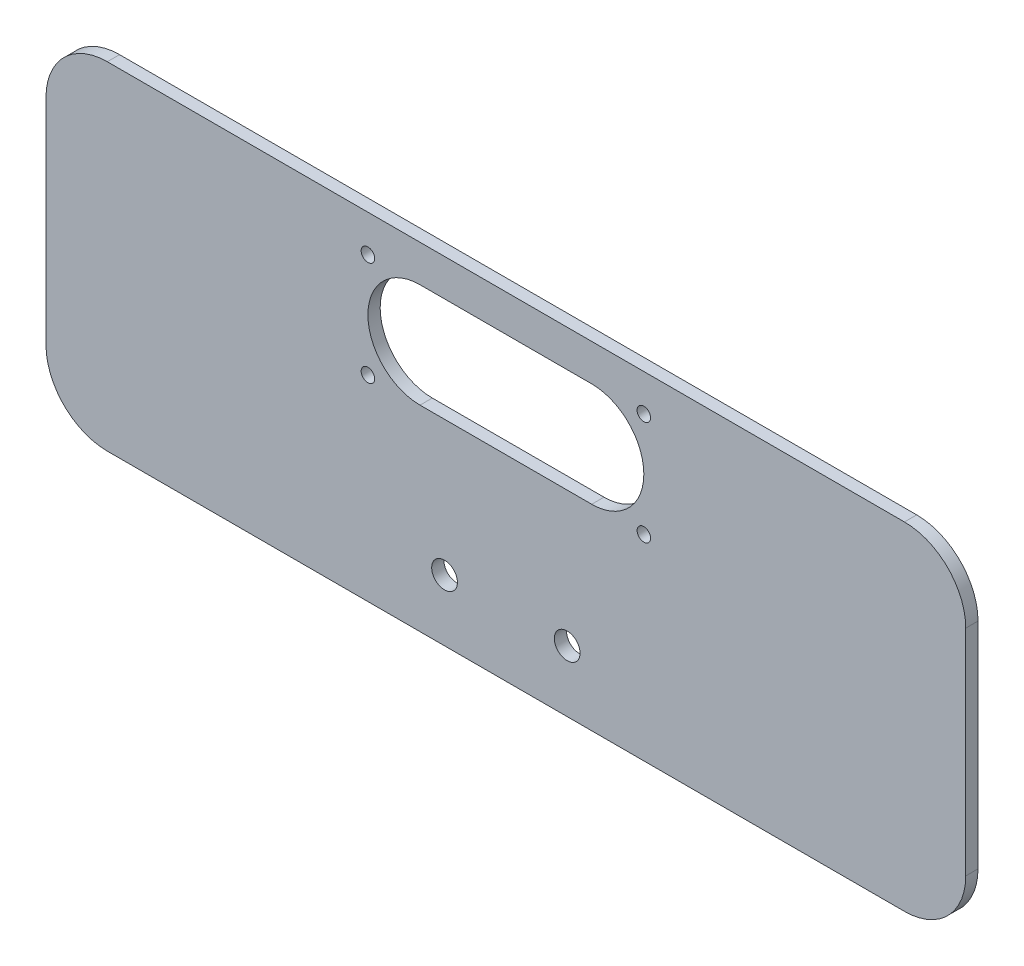
ISO-10303-21;
HEADER;
FILE_DESCRIPTION(('STEP AP214'),'2;1');
FILE_NAME('part.step','',(''),(''),'','','');
FILE_SCHEMA(('AUTOMOTIVE_DESIGN { 1 0 10303 214 1 1 1 1 }'));
ENDSEC;
DATA;
#1=APPLICATION_CONTEXT('core data for automotive mechanical design processes');
#2=APPLICATION_PROTOCOL_DEFINITION('international standard','automotive_design',2000,#1);
#3=PRODUCT_CONTEXT('',#1,'mechanical');
#4=PRODUCT('Part','Part','',(#3));
#5=PRODUCT_RELATED_PRODUCT_CATEGORY('part','',(#4));
#6=PRODUCT_DEFINITION_FORMATION('','',#4);
#7=PRODUCT_DEFINITION_CONTEXT('part definition',#1,'design');
#8=PRODUCT_DEFINITION('design','',#6,#7);
#9=PRODUCT_DEFINITION_SHAPE('','',#8);
#10=(LENGTH_UNIT() NAMED_UNIT(*) SI_UNIT(.MILLI.,.METRE.));
#11=(NAMED_UNIT(*) PLANE_ANGLE_UNIT() SI_UNIT($,.RADIAN.));
#12=(NAMED_UNIT(*) SI_UNIT($,.STERADIAN.) SOLID_ANGLE_UNIT());
#13=UNCERTAINTY_MEASURE_WITH_UNIT(LENGTH_MEASURE(1.E-05),#10,'distance_accuracy_value','');
#14=(GEOMETRIC_REPRESENTATION_CONTEXT(3) GLOBAL_UNCERTAINTY_ASSIGNED_CONTEXT((#13)) GLOBAL_UNIT_ASSIGNED_CONTEXT((#10,
#11,#12)) REPRESENTATION_CONTEXT('',''));
#15=CARTESIAN_POINT('',(0.,0.,0.));
#16=DIRECTION('',(0.,0.,1.));
#17=DIRECTION('',(1.,0.,0.));
#18=AXIS2_PLACEMENT_3D('',#15,#16,#17);
#19=CARTESIAN_POINT('',(65.,-17.5,2.));
#20=DIRECTION('',(0.,0.,1.));
#21=DIRECTION('',(1.,0.,0.));
#22=AXIS2_PLACEMENT_3D('',#19,#20,#21);
#23=PLANE('',#22);
#24=CARTESIAN_POINT('',(22.5,4.50000000000001,2.));
#25=DIRECTION('',(0.,0.,1.));
#26=DIRECTION('',(1.,0.,0.));
#27=AXIS2_PLACEMENT_3D('',#24,#25,#26);
#28=CIRCLE('',#27,1.1);
#29=CARTESIAN_POINT('',(23.6,4.50000000000001,2.));
#30=VERTEX_POINT('',#29);
#31=EDGE_CURVE('E344',#30,#30,#28,.T.);
#32=ORIENTED_EDGE('',*,*,#31,.F.);
#33=EDGE_LOOP('',(#32));
#34=FACE_BOUND('',#33,.T.);
#35=CARTESIAN_POINT('',(-22.5,21.5,2.));
#36=DIRECTION('',(0.,0.,1.));
#37=DIRECTION('',(1.,0.,0.));
#38=AXIS2_PLACEMENT_3D('',#35,#36,#37);
#39=CIRCLE('',#38,1.1);
#40=CARTESIAN_POINT('',(-21.4,21.5,2.));
#41=VERTEX_POINT('',#40);
#42=EDGE_CURVE('E356',#41,#41,#39,.T.);
#43=ORIENTED_EDGE('',*,*,#42,.F.);
#44=EDGE_LOOP('',(#43));
#45=FACE_BOUND('',#44,.T.);
#46=DIRECTION('',(1.,0.,0.));
#47=VECTOR('',#46,1.);
#48=CARTESIAN_POINT('',(-14.,4.50000000000001,2.));
#49=LINE('',#48,#47);
#50=CARTESIAN_POINT('',(-14.,4.50000000000001,2.));
#51=VERTEX_POINT('',#50);
#52=CARTESIAN_POINT('',(14.,4.49999999999998,2.));
#53=VERTEX_POINT('',#52);
#54=EDGE_CURVE('E136',#51,#53,#49,.T.);
#55=ORIENTED_EDGE('',*,*,#54,.F.);
#56=CARTESIAN_POINT('',(-14.,13.,2.));
#57=DIRECTION('',(0.,0.,1.));
#58=DIRECTION('',(1.,0.,0.));
#59=AXIS2_PLACEMENT_3D('',#56,#57,#58);
#60=CIRCLE('',#59,8.5);
#61=CARTESIAN_POINT('',(-14.,21.5,2.));
#62=VERTEX_POINT('',#61);
#63=EDGE_CURVE('E128',#62,#51,#60,.T.);
#64=ORIENTED_EDGE('',*,*,#63,.F.);
#65=DIRECTION('',(-1.,0.,0.));
#66=VECTOR('',#65,1.);
#67=CARTESIAN_POINT('',(-14.,21.5,2.));
#68=LINE('',#67,#66);
#69=CARTESIAN_POINT('',(14.,21.5,2.));
#70=VERTEX_POINT('',#69);
#71=EDGE_CURVE('E151',#70,#62,#68,.T.);
#72=ORIENTED_EDGE('',*,*,#71,.F.);
#73=CARTESIAN_POINT('',(14.,13.,2.));
#74=DIRECTION('',(0.,0.,1.));
#75=DIRECTION('',(1.,0.,0.));
#76=AXIS2_PLACEMENT_3D('',#73,#74,#75);
#77=CIRCLE('',#76,8.5);
#78=EDGE_CURVE('E149',#53,#70,#77,.T.);
#79=ORIENTED_EDGE('',*,*,#78,.F.);
#80=EDGE_LOOP('',(#55,#64,#72,#79));
#81=FACE_BOUND('',#80,.T.);
#82=CARTESIAN_POINT('',(-10.,-17.5,2.));
#83=DIRECTION('',(0.,0.,1.));
#84=DIRECTION('',(1.,0.,0.));
#85=AXIS2_PLACEMENT_3D('',#82,#83,#84);
#86=CIRCLE('',#85,2.1);
#87=CARTESIAN_POINT('',(-7.9,-17.5,2.));
#88=VERTEX_POINT('',#87);
#89=EDGE_CURVE('E167',#88,#88,#86,.T.);
#90=ORIENTED_EDGE('',*,*,#89,.F.);
#91=EDGE_LOOP('',(#90));
#92=FACE_BOUND('',#91,.T.);
#93=CARTESIAN_POINT('',(65.,-17.5,2.));
#94=DIRECTION('',(0.,0.,1.));
#95=DIRECTION('',(1.,0.,0.));
#96=AXIS2_PLACEMENT_3D('',#93,#94,#95);
#97=CIRCLE('',#96,10.);
#98=CARTESIAN_POINT('',(65.,-27.5,2.));
#99=VERTEX_POINT('',#98);
#100=CARTESIAN_POINT('',(75.,-17.5,2.));
#101=VERTEX_POINT('',#100);
#102=EDGE_CURVE('E173',#99,#101,#97,.T.);
#103=ORIENTED_EDGE('',*,*,#102,.T.);
#104=DIRECTION('',(0.,1.,0.));
#105=VECTOR('',#104,1.);
#106=CARTESIAN_POINT('',(75.,17.5,2.));
#107=LINE('',#106,#105);
#108=CARTESIAN_POINT('',(75.,17.5,2.));
#109=VERTEX_POINT('',#108);
#110=EDGE_CURVE('E176',#101,#109,#107,.T.);
#111=ORIENTED_EDGE('',*,*,#110,.T.);
#112=CARTESIAN_POINT('',(65.,17.5,2.));
#113=DIRECTION('',(0.,0.,1.));
#114=DIRECTION('',(-1.,0.,0.));
#115=AXIS2_PLACEMENT_3D('',#112,#113,#114);
#116=CIRCLE('',#115,10.);
#117=CARTESIAN_POINT('',(65.,27.5,2.));
#118=VERTEX_POINT('',#117);
#119=EDGE_CURVE('E179',#109,#118,#116,.T.);
#120=ORIENTED_EDGE('',*,*,#119,.T.);
#121=DIRECTION('',(-1.,0.,0.));
#122=VECTOR('',#121,1.);
#123=CARTESIAN_POINT('',(-65.,27.5,2.));
#124=LINE('',#123,#122);
#125=CARTESIAN_POINT('',(-65.,27.5,2.));
#126=VERTEX_POINT('',#125);
#127=EDGE_CURVE('E181',#118,#126,#124,.T.);
#128=ORIENTED_EDGE('',*,*,#127,.T.);
#129=CARTESIAN_POINT('',(-65.,17.5,2.));
#130=DIRECTION('',(0.,0.,1.));
#131=DIRECTION('',(1.,0.,0.));
#132=AXIS2_PLACEMENT_3D('',#129,#130,#131);
#133=CIRCLE('',#132,10.);
#134=CARTESIAN_POINT('',(-75.,17.5,2.));
#135=VERTEX_POINT('',#134);
#136=EDGE_CURVE('E183',#126,#135,#133,.T.);
#137=ORIENTED_EDGE('',*,*,#136,.T.);
#138=DIRECTION('',(0.,-1.,0.));
#139=VECTOR('',#138,1.);
#140=CARTESIAN_POINT('',(-75.,17.5,2.));
#141=LINE('',#140,#139);
#142=CARTESIAN_POINT('',(-75.,-17.5,2.));
#143=VERTEX_POINT('',#142);
#144=EDGE_CURVE('E185',#135,#143,#141,.T.);
#145=ORIENTED_EDGE('',*,*,#144,.T.);
#146=CARTESIAN_POINT('',(-65.,-17.5,2.));
#147=DIRECTION('',(0.,0.,1.));
#148=DIRECTION('',(1.,0.,0.));
#149=AXIS2_PLACEMENT_3D('',#146,#147,#148);
#150=CIRCLE('',#149,10.);
#151=CARTESIAN_POINT('',(-65.,-27.5,2.));
#152=VERTEX_POINT('',#151);
#153=EDGE_CURVE('E187',#143,#152,#150,.T.);
#154=ORIENTED_EDGE('',*,*,#153,.T.);
#155=DIRECTION('',(1.,0.,0.));
#156=VECTOR('',#155,1.);
#157=CARTESIAN_POINT('',(-65.,-27.5,2.));
#158=LINE('',#157,#156);
#159=EDGE_CURVE('E189',#152,#99,#158,.T.);
#160=ORIENTED_EDGE('',*,*,#159,.T.);
#161=EDGE_LOOP('',(#103,#111,#120,#128,#137,#145,#154,#160));
#162=FACE_BOUND('',#161,.T.);
#163=CARTESIAN_POINT('',(10.,-17.5,2.));
#164=DIRECTION('',(0.,0.,1.));
#165=DIRECTION('',(-1.,0.,0.));
#166=AXIS2_PLACEMENT_3D('',#163,#164,#165);
#167=CIRCLE('',#166,2.1);
#168=CARTESIAN_POINT('',(7.9,-17.5,2.));
#169=VERTEX_POINT('',#168);
#170=EDGE_CURVE('E157',#169,#169,#167,.T.);
#171=ORIENTED_EDGE('',*,*,#170,.F.);
#172=EDGE_LOOP('',(#171));
#173=FACE_BOUND('',#172,.T.);
#174=CARTESIAN_POINT('',(-22.5,4.50000000000001,2.));
#175=DIRECTION('',(0.,0.,1.));
#176=DIRECTION('',(-1.,0.,0.));
#177=AXIS2_PLACEMENT_3D('',#174,#175,#176);
#178=CIRCLE('',#177,1.1);
#179=CARTESIAN_POINT('',(-23.6,4.50000000000001,2.));
#180=VERTEX_POINT('',#179);
#181=EDGE_CURVE('E350',#180,#180,#178,.T.);
#182=ORIENTED_EDGE('',*,*,#181,.F.);
#183=EDGE_LOOP('',(#182));
#184=FACE_BOUND('',#183,.T.);
#185=CARTESIAN_POINT('',(22.5,21.5,2.));
#186=DIRECTION('',(0.,0.,1.));
#187=DIRECTION('',(-1.,0.,0.));
#188=AXIS2_PLACEMENT_3D('',#185,#186,#187);
#189=CIRCLE('',#188,1.1);
#190=CARTESIAN_POINT('',(21.4,21.5,2.));
#191=VERTEX_POINT('',#190);
#192=EDGE_CURVE('E335',#191,#191,#189,.T.);
#193=ORIENTED_EDGE('',*,*,#192,.F.);
#194=EDGE_LOOP('',(#193));
#195=FACE_BOUND('',#194,.T.);
#196=ADVANCED_FACE('F39',(#34,#45,#81,#92,#162,#173,#184,#195),#23,.T.);
#197=CARTESIAN_POINT('',(65.,-17.5,0.));
#198=DIRECTION('',(0.,0.,1.));
#199=DIRECTION('',(1.,0.,0.));
#200=AXIS2_PLACEMENT_3D('',#197,#198,#199);
#201=PLANE('',#200);
#202=CARTESIAN_POINT('',(-10.,-17.5,0.));
#203=DIRECTION('',(0.,0.,1.));
#204=DIRECTION('',(1.,0.,0.));
#205=AXIS2_PLACEMENT_3D('',#202,#203,#204);
#206=CIRCLE('',#205,2.1);
#207=CARTESIAN_POINT('',(-7.9,-17.5,0.));
#208=VERTEX_POINT('',#207);
#209=EDGE_CURVE('E144',#208,#208,#206,.T.);
#210=ORIENTED_EDGE('',*,*,#209,.T.);
#211=EDGE_LOOP('',(#210));
#212=FACE_BOUND('',#211,.T.);
#213=CARTESIAN_POINT('',(65.,-17.5,0.));
#214=DIRECTION('',(0.,0.,1.));
#215=DIRECTION('',(1.,0.,0.));
#216=AXIS2_PLACEMENT_3D('',#213,#214,#215);
#217=CIRCLE('',#216,10.);
#218=CARTESIAN_POINT('',(65.,-27.5,0.));
#219=VERTEX_POINT('',#218);
#220=CARTESIAN_POINT('',(75.,-17.5,0.));
#221=VERTEX_POINT('',#220);
#222=EDGE_CURVE('E170',#219,#221,#217,.T.);
#223=ORIENTED_EDGE('',*,*,#222,.F.);
#224=DIRECTION('',(1.,0.,0.));
#225=VECTOR('',#224,1.);
#226=CARTESIAN_POINT('',(-65.,-27.5,0.));
#227=LINE('',#226,#225);
#228=CARTESIAN_POINT('',(-65.,-27.5,0.));
#229=VERTEX_POINT('',#228);
#230=EDGE_CURVE('E177',#229,#219,#227,.T.);
#231=ORIENTED_EDGE('',*,*,#230,.F.);
#232=CARTESIAN_POINT('',(-65.,-17.5,0.));
#233=DIRECTION('',(0.,0.,1.));
#234=DIRECTION('',(1.,0.,0.));
#235=AXIS2_PLACEMENT_3D('',#232,#233,#234);
#236=CIRCLE('',#235,10.);
#237=CARTESIAN_POINT('',(-75.,-17.5,0.));
#238=VERTEX_POINT('',#237);
#239=EDGE_CURVE('E204',#238,#229,#236,.T.);
#240=ORIENTED_EDGE('',*,*,#239,.F.);
#241=DIRECTION('',(0.,-1.,0.));
#242=VECTOR('',#241,1.);
#243=CARTESIAN_POINT('',(-75.,17.5,0.));
#244=LINE('',#243,#242);
#245=CARTESIAN_POINT('',(-75.,17.5,0.));
#246=VERTEX_POINT('',#245);
#247=EDGE_CURVE('E202',#246,#238,#244,.T.);
#248=ORIENTED_EDGE('',*,*,#247,.F.);
#249=CARTESIAN_POINT('',(-65.,17.5,0.));
#250=DIRECTION('',(0.,0.,1.));
#251=DIRECTION('',(1.,0.,0.));
#252=AXIS2_PLACEMENT_3D('',#249,#250,#251);
#253=CIRCLE('',#252,10.);
#254=CARTESIAN_POINT('',(-65.,27.5,0.));
#255=VERTEX_POINT('',#254);
#256=EDGE_CURVE('E200',#255,#246,#253,.T.);
#257=ORIENTED_EDGE('',*,*,#256,.F.);
#258=DIRECTION('',(-1.,0.,0.));
#259=VECTOR('',#258,1.);
#260=CARTESIAN_POINT('',(-65.,27.5,0.));
#261=LINE('',#260,#259);
#262=CARTESIAN_POINT('',(65.,27.5,0.));
#263=VERTEX_POINT('',#262);
#264=EDGE_CURVE('E198',#263,#255,#261,.T.);
#265=ORIENTED_EDGE('',*,*,#264,.F.);
#266=CARTESIAN_POINT('',(65.,17.5,0.));
#267=DIRECTION('',(0.,0.,1.));
#268=DIRECTION('',(-1.,0.,0.));
#269=AXIS2_PLACEMENT_3D('',#266,#267,#268);
#270=CIRCLE('',#269,10.);
#271=CARTESIAN_POINT('',(75.,17.5,0.));
#272=VERTEX_POINT('',#271);
#273=EDGE_CURVE('E196',#272,#263,#270,.T.);
#274=ORIENTED_EDGE('',*,*,#273,.F.);
#275=DIRECTION('',(0.,1.,0.));
#276=VECTOR('',#275,1.);
#277=CARTESIAN_POINT('',(75.,17.5,0.));
#278=LINE('',#277,#276);
#279=EDGE_CURVE('E194',#221,#272,#278,.T.);
#280=ORIENTED_EDGE('',*,*,#279,.F.);
#281=EDGE_LOOP('',(#223,#231,#240,#248,#257,#265,#274,#280));
#282=FACE_BOUND('',#281,.T.);
#283=CARTESIAN_POINT('',(-14.,13.,0.));
#284=DIRECTION('',(0.,0.,1.));
#285=DIRECTION('',(1.,0.,0.));
#286=AXIS2_PLACEMENT_3D('',#283,#284,#285);
#287=CIRCLE('',#286,8.5);
#288=CARTESIAN_POINT('',(-14.,21.5,0.));
#289=VERTEX_POINT('',#288);
#290=CARTESIAN_POINT('',(-14.,4.50000000000001,0.));
#291=VERTEX_POINT('',#290);
#292=EDGE_CURVE('E62',#289,#291,#287,.T.);
#293=ORIENTED_EDGE('',*,*,#292,.T.);
#294=DIRECTION('',(1.,0.,0.));
#295=VECTOR('',#294,1.);
#296=CARTESIAN_POINT('',(-14.,4.50000000000001,0.));
#297=LINE('',#296,#295);
#298=CARTESIAN_POINT('',(14.,4.49999999999998,0.));
#299=VERTEX_POINT('',#298);
#300=EDGE_CURVE('E143',#291,#299,#297,.T.);
#301=ORIENTED_EDGE('',*,*,#300,.T.);
#302=CARTESIAN_POINT('',(14.,13.,0.));
#303=DIRECTION('',(0.,0.,1.));
#304=DIRECTION('',(1.,0.,0.));
#305=AXIS2_PLACEMENT_3D('',#302,#303,#304);
#306=CIRCLE('',#305,8.5);
#307=CARTESIAN_POINT('',(14.,21.5,0.));
#308=VERTEX_POINT('',#307);
#309=EDGE_CURVE('E159',#299,#308,#306,.T.);
#310=ORIENTED_EDGE('',*,*,#309,.T.);
#311=DIRECTION('',(-1.,0.,0.));
#312=VECTOR('',#311,1.);
#313=CARTESIAN_POINT('',(-14.,21.5,0.));
#314=LINE('',#313,#312);
#315=EDGE_CURVE('E137',#308,#289,#314,.T.);
#316=ORIENTED_EDGE('',*,*,#315,.T.);
#317=EDGE_LOOP('',(#293,#301,#310,#316));
#318=FACE_BOUND('',#317,.T.);
#319=CARTESIAN_POINT('',(10.,-17.5,0.));
#320=DIRECTION('',(0.,0.,1.));
#321=DIRECTION('',(-1.,0.,0.));
#322=AXIS2_PLACEMENT_3D('',#319,#320,#321);
#323=CIRCLE('',#322,2.1);
#324=CARTESIAN_POINT('',(7.9,-17.5,0.));
#325=VERTEX_POINT('',#324);
#326=EDGE_CURVE('E359',#325,#325,#323,.T.);
#327=ORIENTED_EDGE('',*,*,#326,.T.);
#328=EDGE_LOOP('',(#327));
#329=FACE_BOUND('',#328,.T.);
#330=CARTESIAN_POINT('',(-22.5,21.5,0.));
#331=DIRECTION('',(0.,0.,1.));
#332=DIRECTION('',(1.,0.,0.));
#333=AXIS2_PLACEMENT_3D('',#330,#331,#332);
#334=CIRCLE('',#333,1.1);
#335=CARTESIAN_POINT('',(-21.4,21.5,0.));
#336=VERTEX_POINT('',#335);
#337=EDGE_CURVE('E353',#336,#336,#334,.T.);
#338=ORIENTED_EDGE('',*,*,#337,.T.);
#339=EDGE_LOOP('',(#338));
#340=FACE_BOUND('',#339,.T.);
#341=CARTESIAN_POINT('',(-22.5,4.50000000000001,0.));
#342=DIRECTION('',(0.,0.,1.));
#343=DIRECTION('',(-1.,0.,0.));
#344=AXIS2_PLACEMENT_3D('',#341,#342,#343);
#345=CIRCLE('',#344,1.1);
#346=CARTESIAN_POINT('',(-23.6,4.50000000000001,0.));
#347=VERTEX_POINT('',#346);
#348=EDGE_CURVE('E347',#347,#347,#345,.T.);
#349=ORIENTED_EDGE('',*,*,#348,.T.);
#350=EDGE_LOOP('',(#349));
#351=FACE_BOUND('',#350,.T.);
#352=CARTESIAN_POINT('',(22.5,4.50000000000001,0.));
#353=DIRECTION('',(0.,0.,1.));
#354=DIRECTION('',(1.,0.,0.));
#355=AXIS2_PLACEMENT_3D('',#352,#353,#354);
#356=CIRCLE('',#355,1.1);
#357=CARTESIAN_POINT('',(23.6,4.50000000000001,0.));
#358=VERTEX_POINT('',#357);
#359=EDGE_CURVE('E341',#358,#358,#356,.T.);
#360=ORIENTED_EDGE('',*,*,#359,.T.);
#361=EDGE_LOOP('',(#360));
#362=FACE_BOUND('',#361,.T.);
#363=CARTESIAN_POINT('',(22.5,21.5,0.));
#364=DIRECTION('',(0.,0.,1.));
#365=DIRECTION('',(-1.,0.,0.));
#366=AXIS2_PLACEMENT_3D('',#363,#364,#365);
#367=CIRCLE('',#366,1.1);
#368=CARTESIAN_POINT('',(21.4,21.5,0.));
#369=VERTEX_POINT('',#368);
#370=EDGE_CURVE('E338',#369,#369,#367,.T.);
#371=ORIENTED_EDGE('',*,*,#370,.T.);
#372=EDGE_LOOP('',(#371));
#373=FACE_BOUND('',#372,.T.);
#374=ADVANCED_FACE('F234',(#212,#282,#318,#329,#340,#351,#362,#373),#201,.F.);
#375=CARTESIAN_POINT('',(65.,-17.5,2.));
#376=DIRECTION('',(0.,0.,-1.));
#377=DIRECTION('',(-1.,0.,0.));
#378=AXIS2_PLACEMENT_3D('',#375,#376,#377);
#379=CYLINDRICAL_SURFACE('',#378,10.);
#380=ORIENTED_EDGE('',*,*,#222,.T.);
#381=DIRECTION('',(0.,0.,-1.));
#382=VECTOR('',#381,1.);
#383=CARTESIAN_POINT('',(75.,-17.5,2.));
#384=LINE('',#383,#382);
#385=EDGE_CURVE('E11',#101,#221,#384,.T.);
#386=ORIENTED_EDGE('',*,*,#385,.F.);
#387=ORIENTED_EDGE('',*,*,#102,.F.);
#388=DIRECTION('',(0.,0.,-1.));
#389=VECTOR('',#388,1.);
#390=CARTESIAN_POINT('',(65.,-27.5,2.));
#391=LINE('',#390,#389);
#392=EDGE_CURVE('E191',#99,#219,#391,.T.);
#393=ORIENTED_EDGE('',*,*,#392,.T.);
#394=EDGE_LOOP('',(#380,#386,#387,#393));
#395=FACE_BOUND('',#394,.T.);
#396=ADVANCED_FACE('F41',(#395),#379,.T.);
#397=CARTESIAN_POINT('',(75.,17.5,2.));
#398=DIRECTION('',(-1.,0.,0.));
#399=DIRECTION('',(0.,0.,1.));
#400=AXIS2_PLACEMENT_3D('',#397,#398,#399);
#401=PLANE('',#400);
#402=ORIENTED_EDGE('',*,*,#279,.T.);
#403=DIRECTION('',(0.,0.,-1.));
#404=VECTOR('',#403,1.);
#405=CARTESIAN_POINT('',(75.,17.5,2.));
#406=LINE('',#405,#404);
#407=EDGE_CURVE('E47',#109,#272,#406,.T.);
#408=ORIENTED_EDGE('',*,*,#407,.F.);
#409=ORIENTED_EDGE('',*,*,#110,.F.);
#410=ORIENTED_EDGE('',*,*,#385,.T.);
#411=EDGE_LOOP('',(#402,#408,#409,#410));
#412=FACE_BOUND('',#411,.T.);
#413=ADVANCED_FACE('F252',(#412),#401,.F.);
#414=CARTESIAN_POINT('',(65.,17.5,2.));
#415=DIRECTION('',(0.,0.,-1.));
#416=DIRECTION('',(-1.,0.,0.));
#417=AXIS2_PLACEMENT_3D('',#414,#415,#416);
#418=CYLINDRICAL_SURFACE('',#417,10.);
#419=ORIENTED_EDGE('',*,*,#273,.T.);
#420=DIRECTION('',(0.,0.,-1.));
#421=VECTOR('',#420,1.);
#422=CARTESIAN_POINT('',(65.,27.5,2.));
#423=LINE('',#422,#421);
#424=EDGE_CURVE('E221',#118,#263,#423,.T.);
#425=ORIENTED_EDGE('',*,*,#424,.F.);
#426=ORIENTED_EDGE('',*,*,#119,.F.);
#427=ORIENTED_EDGE('',*,*,#407,.T.);
#428=EDGE_LOOP('',(#419,#425,#426,#427));
#429=FACE_BOUND('',#428,.T.);
#430=ADVANCED_FACE('F228',(#429),#418,.T.);
#431=CARTESIAN_POINT('',(-65.,27.5,2.));
#432=DIRECTION('',(0.,-1.,0.));
#433=DIRECTION('',(0.,0.,-1.));
#434=AXIS2_PLACEMENT_3D('',#431,#432,#433);
#435=PLANE('',#434);
#436=ORIENTED_EDGE('',*,*,#264,.T.);
#437=DIRECTION('',(0.,0.,-1.));
#438=VECTOR('',#437,1.);
#439=CARTESIAN_POINT('',(-65.,27.5,2.));
#440=LINE('',#439,#438);
#441=EDGE_CURVE('E218',#126,#255,#440,.T.);
#442=ORIENTED_EDGE('',*,*,#441,.F.);
#443=ORIENTED_EDGE('',*,*,#127,.F.);
#444=ORIENTED_EDGE('',*,*,#424,.T.);
#445=EDGE_LOOP('',(#436,#442,#443,#444));
#446=FACE_BOUND('',#445,.T.);
#447=ADVANCED_FACE('F240',(#446),#435,.F.);
#448=CARTESIAN_POINT('',(-65.,17.5,2.));
#449=DIRECTION('',(0.,0.,-1.));
#450=DIRECTION('',(-1.,0.,0.));
#451=AXIS2_PLACEMENT_3D('',#448,#449,#450);
#452=CYLINDRICAL_SURFACE('',#451,10.);
#453=ORIENTED_EDGE('',*,*,#256,.T.);
#454=DIRECTION('',(0.,0.,-1.));
#455=VECTOR('',#454,1.);
#456=CARTESIAN_POINT('',(-75.,17.5,2.));
#457=LINE('',#456,#455);
#458=EDGE_CURVE('E215',#135,#246,#457,.T.);
#459=ORIENTED_EDGE('',*,*,#458,.F.);
#460=ORIENTED_EDGE('',*,*,#136,.F.);
#461=ORIENTED_EDGE('',*,*,#441,.T.);
#462=EDGE_LOOP('',(#453,#459,#460,#461));
#463=FACE_BOUND('',#462,.T.);
#464=ADVANCED_FACE('F244',(#463),#452,.T.);
#465=CARTESIAN_POINT('',(-75.,17.5,2.));
#466=DIRECTION('',(1.,0.,0.));
#467=DIRECTION('',(0.,0.,-1.));
#468=AXIS2_PLACEMENT_3D('',#465,#466,#467);
#469=PLANE('',#468);
#470=ORIENTED_EDGE('',*,*,#247,.T.);
#471=DIRECTION('',(0.,0.,-1.));
#472=VECTOR('',#471,1.);
#473=CARTESIAN_POINT('',(-75.,-17.5,2.));
#474=LINE('',#473,#472);
#475=EDGE_CURVE('E212',#143,#238,#474,.T.);
#476=ORIENTED_EDGE('',*,*,#475,.F.);
#477=ORIENTED_EDGE('',*,*,#144,.F.);
#478=ORIENTED_EDGE('',*,*,#458,.T.);
#479=EDGE_LOOP('',(#470,#476,#477,#478));
#480=FACE_BOUND('',#479,.T.);
#481=ADVANCED_FACE('F265',(#480),#469,.F.);
#482=CARTESIAN_POINT('',(-65.,-17.5,2.));
#483=DIRECTION('',(0.,0.,-1.));
#484=DIRECTION('',(-1.,0.,0.));
#485=AXIS2_PLACEMENT_3D('',#482,#483,#484);
#486=CYLINDRICAL_SURFACE('',#485,10.);
#487=ORIENTED_EDGE('',*,*,#239,.T.);
#488=DIRECTION('',(0.,0.,-1.));
#489=VECTOR('',#488,1.);
#490=CARTESIAN_POINT('',(-65.,-27.5,2.));
#491=LINE('',#490,#489);
#492=EDGE_CURVE('E209',#152,#229,#491,.T.);
#493=ORIENTED_EDGE('',*,*,#492,.F.);
#494=ORIENTED_EDGE('',*,*,#153,.F.);
#495=ORIENTED_EDGE('',*,*,#475,.T.);
#496=EDGE_LOOP('',(#487,#493,#494,#495));
#497=FACE_BOUND('',#496,.T.);
#498=ADVANCED_FACE('F263',(#497),#486,.T.);
#499=CARTESIAN_POINT('',(-65.,-27.5,2.));
#500=DIRECTION('',(0.,1.,0.));
#501=DIRECTION('',(0.,0.,1.));
#502=AXIS2_PLACEMENT_3D('',#499,#500,#501);
#503=PLANE('',#502);
#504=ORIENTED_EDGE('',*,*,#230,.T.);
#505=ORIENTED_EDGE('',*,*,#392,.F.);
#506=ORIENTED_EDGE('',*,*,#159,.F.);
#507=ORIENTED_EDGE('',*,*,#492,.T.);
#508=EDGE_LOOP('',(#504,#505,#506,#507));
#509=FACE_BOUND('',#508,.T.);
#510=ADVANCED_FACE('F258',(#509),#503,.F.);
#511=CARTESIAN_POINT('',(-10.,-17.5,2.));
#512=DIRECTION('',(0.,0.,-1.));
#513=DIRECTION('',(-1.,0.,0.));
#514=AXIS2_PLACEMENT_3D('',#511,#512,#513);
#515=CYLINDRICAL_SURFACE('',#514,2.1);
#516=ORIENTED_EDGE('',*,*,#89,.T.);
#517=EDGE_LOOP('',(#516));
#518=FACE_BOUND('',#517,.T.);
#519=ORIENTED_EDGE('',*,*,#209,.F.);
#520=EDGE_LOOP('',(#519));
#521=FACE_BOUND('',#520,.T.);
#522=ADVANCED_FACE('F285',(#518,#521),#515,.F.);
#523=CARTESIAN_POINT('',(-14.,13.,2.));
#524=DIRECTION('',(0.,0.,-1.));
#525=DIRECTION('',(-1.,0.,0.));
#526=AXIS2_PLACEMENT_3D('',#523,#524,#525);
#527=CYLINDRICAL_SURFACE('',#526,8.5);
#528=ORIENTED_EDGE('',*,*,#292,.F.);
#529=DIRECTION('',(0.,0.,-1.));
#530=VECTOR('',#529,1.);
#531=CARTESIAN_POINT('',(-14.,21.5,2.));
#532=LINE('',#531,#530);
#533=EDGE_CURVE('E132',#62,#289,#532,.T.);
#534=ORIENTED_EDGE('',*,*,#533,.F.);
#535=ORIENTED_EDGE('',*,*,#63,.T.);
#536=DIRECTION('',(0.,0.,-1.));
#537=VECTOR('',#536,1.);
#538=CARTESIAN_POINT('',(-14.,4.50000000000001,2.));
#539=LINE('',#538,#537);
#540=EDGE_CURVE('E131',#51,#291,#539,.T.);
#541=ORIENTED_EDGE('',*,*,#540,.T.);
#542=EDGE_LOOP('',(#528,#534,#535,#541));
#543=FACE_BOUND('',#542,.T.);
#544=ADVANCED_FACE('F130',(#543),#527,.F.);
#545=CARTESIAN_POINT('',(-14.,4.50000000000001,2.));
#546=DIRECTION('',(0.,1.,0.));
#547=DIRECTION('',(0.,0.,1.));
#548=AXIS2_PLACEMENT_3D('',#545,#546,#547);
#549=PLANE('',#548);
#550=ORIENTED_EDGE('',*,*,#300,.F.);
#551=ORIENTED_EDGE('',*,*,#540,.F.);
#552=ORIENTED_EDGE('',*,*,#54,.T.);
#553=DIRECTION('',(0.,0.,-1.));
#554=VECTOR('',#553,1.);
#555=CARTESIAN_POINT('',(14.,4.49999999999998,2.));
#556=LINE('',#555,#554);
#557=EDGE_CURVE('E145',#53,#299,#556,.T.);
#558=ORIENTED_EDGE('',*,*,#557,.T.);
#559=EDGE_LOOP('',(#550,#551,#552,#558));
#560=FACE_BOUND('',#559,.T.);
#561=ADVANCED_FACE('F140',(#560),#549,.T.);
#562=CARTESIAN_POINT('',(14.,13.,2.));
#563=DIRECTION('',(0.,0.,-1.));
#564=DIRECTION('',(-1.,0.,0.));
#565=AXIS2_PLACEMENT_3D('',#562,#563,#564);
#566=CYLINDRICAL_SURFACE('',#565,8.5);
#567=ORIENTED_EDGE('',*,*,#309,.F.);
#568=ORIENTED_EDGE('',*,*,#557,.F.);
#569=ORIENTED_EDGE('',*,*,#78,.T.);
#570=DIRECTION('',(0.,0.,-1.));
#571=VECTOR('',#570,1.);
#572=CARTESIAN_POINT('',(14.,21.5,2.));
#573=LINE('',#572,#571);
#574=EDGE_CURVE('E54',#70,#308,#573,.T.);
#575=ORIENTED_EDGE('',*,*,#574,.T.);
#576=EDGE_LOOP('',(#567,#568,#569,#575));
#577=FACE_BOUND('',#576,.T.);
#578=ADVANCED_FACE('F302',(#577),#566,.F.);
#579=CARTESIAN_POINT('',(-14.,21.5,2.));
#580=DIRECTION('',(0.,-1.,0.));
#581=DIRECTION('',(1.,0.,0.));
#582=AXIS2_PLACEMENT_3D('',#579,#580,#581);
#583=PLANE('',#582);
#584=ORIENTED_EDGE('',*,*,#315,.F.);
#585=ORIENTED_EDGE('',*,*,#574,.F.);
#586=ORIENTED_EDGE('',*,*,#71,.T.);
#587=ORIENTED_EDGE('',*,*,#533,.T.);
#588=EDGE_LOOP('',(#584,#585,#586,#587));
#589=FACE_BOUND('',#588,.T.);
#590=ADVANCED_FACE('F307',(#589),#583,.T.);
#591=CARTESIAN_POINT('',(10.,-17.5,2.));
#592=DIRECTION('',(0.,0.,-1.));
#593=DIRECTION('',(-1.,0.,0.));
#594=AXIS2_PLACEMENT_3D('',#591,#592,#593);
#595=CYLINDRICAL_SURFACE('',#594,2.1);
#596=ORIENTED_EDGE('',*,*,#170,.T.);
#597=EDGE_LOOP('',(#596));
#598=FACE_BOUND('',#597,.T.);
#599=ORIENTED_EDGE('',*,*,#326,.F.);
#600=EDGE_LOOP('',(#599));
#601=FACE_BOUND('',#600,.T.);
#602=ADVANCED_FACE('F311',(#598,#601),#595,.F.);
#603=CARTESIAN_POINT('',(-22.5,21.5,2.));
#604=DIRECTION('',(0.,0.,-1.));
#605=DIRECTION('',(-1.,0.,0.));
#606=AXIS2_PLACEMENT_3D('',#603,#604,#605);
#607=CYLINDRICAL_SURFACE('',#606,1.1);
#608=ORIENTED_EDGE('',*,*,#42,.T.);
#609=EDGE_LOOP('',(#608));
#610=FACE_BOUND('',#609,.T.);
#611=ORIENTED_EDGE('',*,*,#337,.F.);
#612=EDGE_LOOP('',(#611));
#613=FACE_BOUND('',#612,.T.);
#614=ADVANCED_FACE('F314',(#610,#613),#607,.F.);
#615=CARTESIAN_POINT('',(-22.5,4.50000000000001,2.));
#616=DIRECTION('',(0.,0.,-1.));
#617=DIRECTION('',(-1.,0.,0.));
#618=AXIS2_PLACEMENT_3D('',#615,#616,#617);
#619=CYLINDRICAL_SURFACE('',#618,1.1);
#620=ORIENTED_EDGE('',*,*,#181,.T.);
#621=EDGE_LOOP('',(#620));
#622=FACE_BOUND('',#621,.T.);
#623=ORIENTED_EDGE('',*,*,#348,.F.);
#624=EDGE_LOOP('',(#623));
#625=FACE_BOUND('',#624,.T.);
#626=ADVANCED_FACE('F318',(#622,#625),#619,.F.);
#627=CARTESIAN_POINT('',(22.5,4.50000000000001,2.));
#628=DIRECTION('',(0.,0.,-1.));
#629=DIRECTION('',(-1.,0.,0.));
#630=AXIS2_PLACEMENT_3D('',#627,#628,#629);
#631=CYLINDRICAL_SURFACE('',#630,1.1);
#632=ORIENTED_EDGE('',*,*,#31,.T.);
#633=EDGE_LOOP('',(#632));
#634=FACE_BOUND('',#633,.T.);
#635=ORIENTED_EDGE('',*,*,#359,.F.);
#636=EDGE_LOOP('',(#635));
#637=FACE_BOUND('',#636,.T.);
#638=ADVANCED_FACE('F322',(#634,#637),#631,.F.);
#639=CARTESIAN_POINT('',(22.5,21.5,2.));
#640=DIRECTION('',(0.,0.,-1.));
#641=DIRECTION('',(-1.,0.,0.));
#642=AXIS2_PLACEMENT_3D('',#639,#640,#641);
#643=CYLINDRICAL_SURFACE('',#642,1.1);
#644=ORIENTED_EDGE('',*,*,#192,.T.);
#645=EDGE_LOOP('',(#644));
#646=FACE_BOUND('',#645,.T.);
#647=ORIENTED_EDGE('',*,*,#370,.F.);
#648=EDGE_LOOP('',(#647));
#649=FACE_BOUND('',#648,.T.);
#650=ADVANCED_FACE('F326',(#646,#649),#643,.F.);
#651=CLOSED_SHELL('',(#196,#374,#396,#413,#430,#447,#464,#481,#498,#510,#522,#544,#561,#578,
#590,#602,#614,#626,#638,#650));
#652=MANIFOLD_SOLID_BREP('B2',#651);
#653=ADVANCED_BREP_SHAPE_REPRESENTATION('',(#18,#652),#14);
#654=SHAPE_DEFINITION_REPRESENTATION(#9,#653);
ENDSEC;
END-ISO-10303-21;
